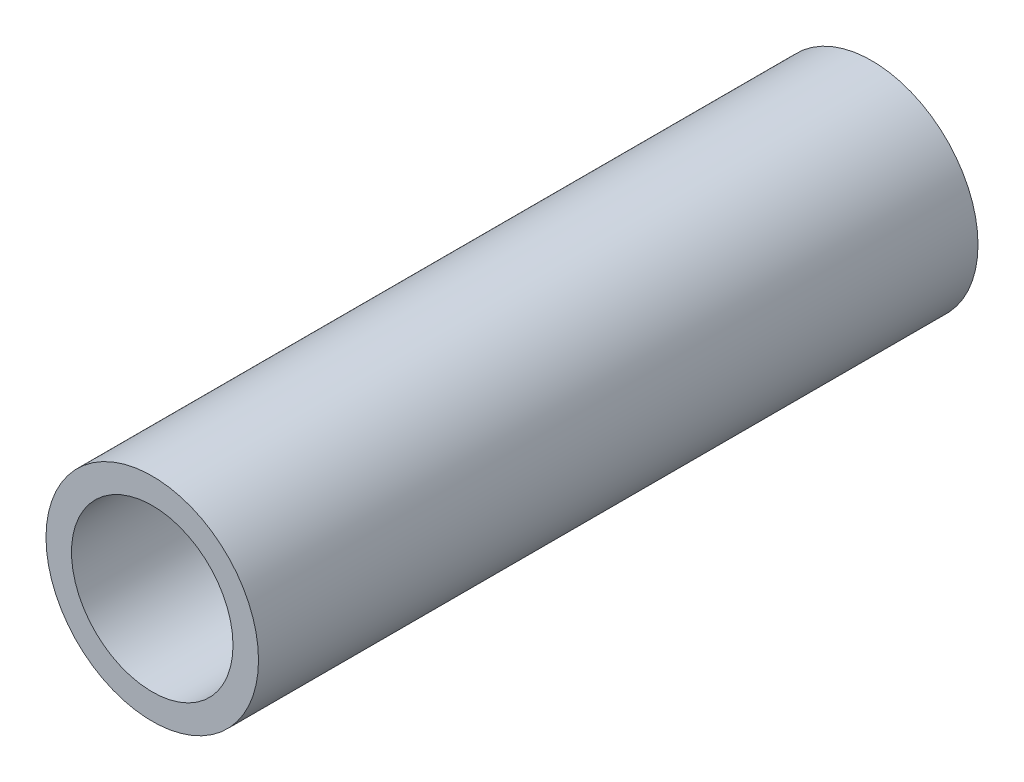
ISO-10303-21;
HEADER;
FILE_DESCRIPTION(('STEP AP214'),'2;1');
FILE_NAME('part.step','',(''),(''),'','','');
FILE_SCHEMA(('AUTOMOTIVE_DESIGN { 1 0 10303 214 1 1 1 1 }'));
ENDSEC;
DATA;
#1=APPLICATION_CONTEXT('core data for automotive mechanical design processes');
#2=APPLICATION_PROTOCOL_DEFINITION('international standard','automotive_design',2000,#1);
#3=PRODUCT_CONTEXT('',#1,'mechanical');
#4=PRODUCT('Part','Part','',(#3));
#5=PRODUCT_RELATED_PRODUCT_CATEGORY('part','',(#4));
#6=PRODUCT_DEFINITION_FORMATION('','',#4);
#7=PRODUCT_DEFINITION_CONTEXT('part definition',#1,'design');
#8=PRODUCT_DEFINITION('design','',#6,#7);
#9=PRODUCT_DEFINITION_SHAPE('','',#8);
#10=(LENGTH_UNIT() NAMED_UNIT(*) SI_UNIT(.MILLI.,.METRE.));
#11=(NAMED_UNIT(*) PLANE_ANGLE_UNIT() SI_UNIT($,.RADIAN.));
#12=(NAMED_UNIT(*) SI_UNIT($,.STERADIAN.) SOLID_ANGLE_UNIT());
#13=UNCERTAINTY_MEASURE_WITH_UNIT(LENGTH_MEASURE(1.E-05),#10,'distance_accuracy_value','');
#14=(GEOMETRIC_REPRESENTATION_CONTEXT(3) GLOBAL_UNCERTAINTY_ASSIGNED_CONTEXT((#13)) GLOBAL_UNIT_ASSIGNED_CONTEXT((#10,
#11,#12)) REPRESENTATION_CONTEXT('',''));
#15=CARTESIAN_POINT('',(0.,0.,0.));
#16=DIRECTION('',(0.,0.,1.));
#17=DIRECTION('',(1.,0.,0.));
#18=AXIS2_PLACEMENT_3D('',#15,#16,#17);
#19=CARTESIAN_POINT('',(0.,0.,10.75));
#20=DIRECTION('',(0.,0.,1.));
#21=DIRECTION('',(1.,0.,0.));
#22=AXIS2_PLACEMENT_3D('',#19,#20,#21);
#23=PLANE('',#22);
#24=CARTESIAN_POINT('',(0.,0.,10.75));
#25=DIRECTION('',(0.,0.,1.));
#26=DIRECTION('',(1.,0.,0.));
#27=AXIS2_PLACEMENT_3D('',#24,#25,#26);
#28=CIRCLE('',#27,3.175);
#29=CARTESIAN_POINT('',(3.175,0.,10.75));
#30=VERTEX_POINT('',#29);
#31=EDGE_CURVE('E10',#30,#30,#28,.T.);
#32=ORIENTED_EDGE('',*,*,#31,.T.);
#33=EDGE_LOOP('',(#32));
#34=FACE_BOUND('',#33,.T.);
#35=CARTESIAN_POINT('',(0.,0.,10.75));
#36=DIRECTION('',(0.,0.,1.));
#37=DIRECTION('',(1.,0.,0.));
#38=AXIS2_PLACEMENT_3D('',#35,#36,#37);
#39=CIRCLE('',#38,2.413);
#40=CARTESIAN_POINT('',(2.413,0.,10.75));
#41=VERTEX_POINT('',#40);
#42=EDGE_CURVE('E42',#41,#41,#39,.T.);
#43=ORIENTED_EDGE('',*,*,#42,.F.);
#44=EDGE_LOOP('',(#43));
#45=FACE_BOUND('',#44,.T.);
#46=ADVANCED_FACE('F31',(#34,#45),#23,.T.);
#47=CARTESIAN_POINT('',(0.,0.,-10.75));
#48=DIRECTION('',(0.,0.,1.));
#49=DIRECTION('',(1.,0.,0.));
#50=AXIS2_PLACEMENT_3D('',#47,#48,#49);
#51=PLANE('',#50);
#52=CARTESIAN_POINT('',(0.,0.,-10.75));
#53=DIRECTION('',(0.,0.,1.));
#54=DIRECTION('',(1.,0.,0.));
#55=AXIS2_PLACEMENT_3D('',#52,#53,#54);
#56=CIRCLE('',#55,3.175);
#57=CARTESIAN_POINT('',(3.175,0.,-10.75));
#58=VERTEX_POINT('',#57);
#59=EDGE_CURVE('E35',#58,#58,#56,.T.);
#60=ORIENTED_EDGE('',*,*,#59,.F.);
#61=EDGE_LOOP('',(#60));
#62=FACE_BOUND('',#61,.T.);
#63=CARTESIAN_POINT('',(0.,0.,-10.75));
#64=DIRECTION('',(0.,0.,1.));
#65=DIRECTION('',(1.,0.,0.));
#66=AXIS2_PLACEMENT_3D('',#63,#64,#65);
#67=CIRCLE('',#66,2.413);
#68=CARTESIAN_POINT('',(2.413,0.,-10.75));
#69=VERTEX_POINT('',#68);
#70=EDGE_CURVE('E44',#69,#69,#67,.T.);
#71=ORIENTED_EDGE('',*,*,#70,.T.);
#72=EDGE_LOOP('',(#71));
#73=FACE_BOUND('',#72,.T.);
#74=ADVANCED_FACE('F54',(#62,#73),#51,.F.);
#75=CARTESIAN_POINT('',(0.,0.,10.75));
#76=DIRECTION('',(0.,0.,-1.));
#77=DIRECTION('',(-1.,0.,0.));
#78=AXIS2_PLACEMENT_3D('',#75,#76,#77);
#79=CYLINDRICAL_SURFACE('',#78,3.175);
#80=ORIENTED_EDGE('',*,*,#31,.F.);
#81=EDGE_LOOP('',(#80));
#82=FACE_BOUND('',#81,.T.);
#83=ORIENTED_EDGE('',*,*,#59,.T.);
#84=EDGE_LOOP('',(#83));
#85=FACE_BOUND('',#84,.T.);
#86=ADVANCED_FACE('F33',(#82,#85),#79,.T.);
#87=CARTESIAN_POINT('',(0.,0.,10.75));
#88=DIRECTION('',(0.,0.,-1.));
#89=DIRECTION('',(-1.,0.,0.));
#90=AXIS2_PLACEMENT_3D('',#87,#88,#89);
#91=CYLINDRICAL_SURFACE('',#90,2.413);
#92=ORIENTED_EDGE('',*,*,#42,.T.);
#93=EDGE_LOOP('',(#92));
#94=FACE_BOUND('',#93,.T.);
#95=ORIENTED_EDGE('',*,*,#70,.F.);
#96=EDGE_LOOP('',(#95));
#97=FACE_BOUND('',#96,.T.);
#98=ADVANCED_FACE('F50',(#94,#97),#91,.F.);
#99=CLOSED_SHELL('',(#46,#74,#86,#98));
#100=MANIFOLD_SOLID_BREP('B2',#99);
#101=ADVANCED_BREP_SHAPE_REPRESENTATION('',(#18,#100),#14);
#102=SHAPE_DEFINITION_REPRESENTATION(#9,#101);
ENDSEC;
END-ISO-10303-21;
